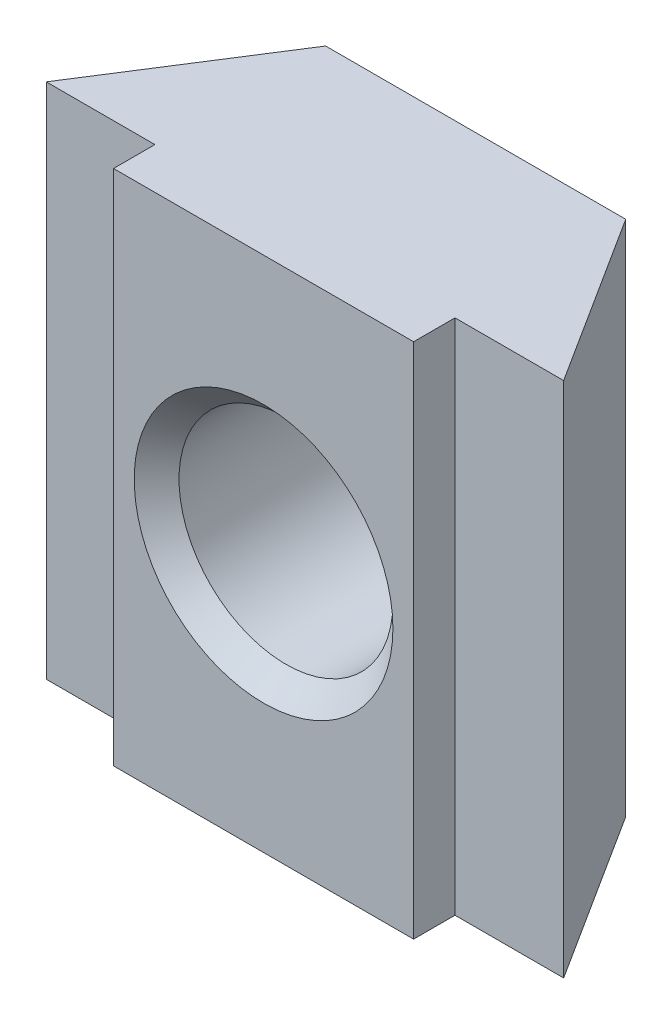
ISO-10303-21;
HEADER;
FILE_DESCRIPTION(('STEP AP214'),'2;1');
FILE_NAME('part.step','',(''),(''),'','','');
FILE_SCHEMA(('AUTOMOTIVE_DESIGN { 1 0 10303 214 1 1 1 1 }'));
ENDSEC;
DATA;
#1=APPLICATION_CONTEXT('core data for automotive mechanical design processes');
#2=APPLICATION_PROTOCOL_DEFINITION('international standard','automotive_design',2000,#1);
#3=PRODUCT_CONTEXT('',#1,'mechanical');
#4=PRODUCT('Part','Part','',(#3));
#5=PRODUCT_RELATED_PRODUCT_CATEGORY('part','',(#4));
#6=PRODUCT_DEFINITION_FORMATION('','',#4);
#7=PRODUCT_DEFINITION_CONTEXT('part definition',#1,'design');
#8=PRODUCT_DEFINITION('design','',#6,#7);
#9=PRODUCT_DEFINITION_SHAPE('','',#8);
#10=(LENGTH_UNIT() NAMED_UNIT(*) SI_UNIT(.MILLI.,.METRE.));
#11=(NAMED_UNIT(*) PLANE_ANGLE_UNIT() SI_UNIT($,.RADIAN.));
#12=(NAMED_UNIT(*) SI_UNIT($,.STERADIAN.) SOLID_ANGLE_UNIT());
#13=UNCERTAINTY_MEASURE_WITH_UNIT(LENGTH_MEASURE(1.E-05),#10,'distance_accuracy_value','');
#14=(GEOMETRIC_REPRESENTATION_CONTEXT(3) GLOBAL_UNCERTAINTY_ASSIGNED_CONTEXT((#13)) GLOBAL_UNIT_ASSIGNED_CONTEXT((#10,
#11,#12)) REPRESENTATION_CONTEXT('',''));
#15=CARTESIAN_POINT('',(0.,0.,0.));
#16=DIRECTION('',(0.,0.,1.));
#17=DIRECTION('',(1.,0.,0.));
#18=AXIS2_PLACEMENT_3D('',#15,#16,#17);
#19=CARTESIAN_POINT('',(13.,-21.5,-9.30000000010978));
#20=DIRECTION('',(0.,0.,1.));
#21=DIRECTION('',(1.,0.,0.));
#22=AXIS2_PLACEMENT_3D('',#19,#20,#21);
#23=CONICAL_SURFACE('',#22,2.49999999990723,0.785398163397448);
#24=CARTESIAN_POINT('',(13.,-21.5,-9.29999999999609));
#25=DIRECTION('',(0.,0.,1.));
#26=DIRECTION('',(1.,0.,0.));
#27=AXIS2_PLACEMENT_3D('',#24,#25,#26);
#28=CIRCLE('',#27,2.50000000002092);
#29=CARTESIAN_POINT('',(15.5000000000209,-21.5,-9.29999999999609));
#30=VERTEX_POINT('',#29);
#31=EDGE_CURVE('E20',#30,#30,#28,.F.);
#32=ORIENTED_EDGE('',*,*,#31,.F.);
#33=EDGE_LOOP('',(#32));
#34=FACE_BOUND('',#33,.T.);
#35=CARTESIAN_POINT('',(13.,-21.5,-9.733));
#36=DIRECTION('',(0.,0.,1.));
#37=DIRECTION('',(1.,0.,0.));
#38=AXIS2_PLACEMENT_3D('',#35,#36,#37);
#39=CIRCLE('',#38,2.067);
#40=CARTESIAN_POINT('',(15.067,-21.5,-9.733));
#41=VERTEX_POINT('',#40);
#42=EDGE_CURVE('E122',#41,#41,#39,.F.);
#43=ORIENTED_EDGE('',*,*,#42,.T.);
#44=EDGE_LOOP('',(#43));
#45=FACE_BOUND('',#44,.T.);
#46=ADVANCED_FACE('F17',(#34,#45),#23,.F.);
#47=CARTESIAN_POINT('',(10.1,-26.5,-9.3));
#48=DIRECTION('',(-1.,0.,0.));
#49=DIRECTION('',(0.,0.,1.));
#50=AXIS2_PLACEMENT_3D('',#47,#48,#49);
#51=PLANE('',#50);
#52=DIRECTION('',(0.,0.,1.));
#53=VECTOR('',#52,1.);
#54=CARTESIAN_POINT('',(10.1,-26.5,-9.3));
#55=LINE('',#54,#53);
#56=CARTESIAN_POINT('',(10.1,-26.5,-10.1));
#57=VERTEX_POINT('',#56);
#58=CARTESIAN_POINT('',(10.1,-26.5,-9.3));
#59=VERTEX_POINT('',#58);
#60=EDGE_CURVE('E125',#57,#59,#55,.T.);
#61=ORIENTED_EDGE('',*,*,#60,.T.);
#62=DIRECTION('',(0.,1.,0.));
#63=VECTOR('',#62,1.);
#64=CARTESIAN_POINT('',(10.1,-26.5,-9.3));
#65=LINE('',#64,#63);
#66=CARTESIAN_POINT('',(10.1,-16.5,-9.3));
#67=VERTEX_POINT('',#66);
#68=EDGE_CURVE('E104',#67,#59,#65,.F.);
#69=ORIENTED_EDGE('',*,*,#68,.F.);
#70=DIRECTION('',(0.,0.,1.));
#71=VECTOR('',#70,1.);
#72=CARTESIAN_POINT('',(10.1,-16.5,-9.3));
#73=LINE('',#72,#71);
#74=CARTESIAN_POINT('',(10.1,-16.5,-10.1));
#75=VERTEX_POINT('',#74);
#76=EDGE_CURVE('E79',#67,#75,#73,.F.);
#77=ORIENTED_EDGE('',*,*,#76,.T.);
#78=DIRECTION('',(0.,1.,0.));
#79=VECTOR('',#78,1.);
#80=CARTESIAN_POINT('',(10.1,-26.5,-10.1));
#81=LINE('',#80,#79);
#82=EDGE_CURVE('E103',#57,#75,#81,.T.);
#83=ORIENTED_EDGE('',*,*,#82,.F.);
#84=EDGE_LOOP('',(#61,#69,#77,#83));
#85=FACE_BOUND('',#84,.T.);
#86=ADVANCED_FACE('F263',(#85),#51,.T.);
#87=CARTESIAN_POINT('',(13.,-21.5,-11.35));
#88=DIRECTION('',(0.,0.,1.));
#89=DIRECTION('',(1.,0.,0.));
#90=AXIS2_PLACEMENT_3D('',#87,#88,#89);
#91=CYLINDRICAL_SURFACE('',#90,2.067);
#92=CARTESIAN_POINT('',(13.,-21.5,-12.9670000000601));
#93=DIRECTION('',(0.,0.,-1.));
#94=DIRECTION('',(-1.,0.,0.));
#95=AXIS2_PLACEMENT_3D('',#92,#93,#94);
#96=CIRCLE('',#95,2.06700000003411);
#97=CARTESIAN_POINT('',(10.9329999999659,-21.5,-12.9670000000601));
#98=VERTEX_POINT('',#97);
#99=EDGE_CURVE('E116',#98,#98,#96,.T.);
#100=ORIENTED_EDGE('',*,*,#99,.T.);
#101=EDGE_LOOP('',(#100));
#102=FACE_BOUND('',#101,.T.);
#103=ORIENTED_EDGE('',*,*,#42,.F.);
#104=EDGE_LOOP('',(#103));
#105=FACE_BOUND('',#104,.T.);
#106=ADVANCED_FACE('F254',(#102,#105),#91,.F.);
#107=CARTESIAN_POINT('',(15.9,-26.5,-10.1));
#108=DIRECTION('',(1.,0.,0.));
#109=DIRECTION('',(0.,0.,-1.));
#110=AXIS2_PLACEMENT_3D('',#107,#108,#109);
#111=PLANE('',#110);
#112=DIRECTION('',(0.,0.,-1.));
#113=VECTOR('',#112,1.);
#114=CARTESIAN_POINT('',(15.9,-26.5,-10.1));
#115=LINE('',#114,#113);
#116=CARTESIAN_POINT('',(15.9,-26.5,-9.3));
#117=VERTEX_POINT('',#116);
#118=CARTESIAN_POINT('',(15.9,-26.5,-10.1));
#119=VERTEX_POINT('',#118);
#120=EDGE_CURVE('E120',#117,#119,#115,.T.);
#121=ORIENTED_EDGE('',*,*,#120,.T.);
#122=DIRECTION('',(0.,1.,0.));
#123=VECTOR('',#122,1.);
#124=CARTESIAN_POINT('',(15.9,-26.5,-10.1));
#125=LINE('',#124,#123);
#126=CARTESIAN_POINT('',(15.9,-16.5,-10.1));
#127=VERTEX_POINT('',#126);
#128=EDGE_CURVE('E91',#127,#119,#125,.F.);
#129=ORIENTED_EDGE('',*,*,#128,.F.);
#130=DIRECTION('',(0.,0.,-1.));
#131=VECTOR('',#130,1.);
#132=CARTESIAN_POINT('',(15.9,-16.5,-9.3));
#133=LINE('',#132,#131);
#134=CARTESIAN_POINT('',(15.9,-16.5,-9.3));
#135=VERTEX_POINT('',#134);
#136=EDGE_CURVE('E85',#127,#135,#133,.F.);
#137=ORIENTED_EDGE('',*,*,#136,.T.);
#138=DIRECTION('',(0.,1.,0.));
#139=VECTOR('',#138,1.);
#140=CARTESIAN_POINT('',(15.9,-26.5,-9.3));
#141=LINE('',#140,#139);
#142=EDGE_CURVE('E88',#117,#135,#141,.T.);
#143=ORIENTED_EDGE('',*,*,#142,.F.);
#144=EDGE_LOOP('',(#121,#129,#137,#143));
#145=FACE_BOUND('',#144,.T.);
#146=ADVANCED_FACE('F87',(#145),#111,.T.);
#147=CARTESIAN_POINT('',(15.9,-26.5,-9.3));
#148=DIRECTION('',(0.,0.,1.));
#149=DIRECTION('',(1.,0.,0.));
#150=AXIS2_PLACEMENT_3D('',#147,#148,#149);
#151=PLANE('',#150);
#152=DIRECTION('',(1.,0.,0.));
#153=VECTOR('',#152,1.);
#154=CARTESIAN_POINT('',(13.,-26.5,-9.3));
#155=LINE('',#154,#153);
#156=EDGE_CURVE('E102',#117,#59,#155,.F.);
#157=ORIENTED_EDGE('',*,*,#156,.F.);
#158=ORIENTED_EDGE('',*,*,#142,.T.);
#159=DIRECTION('',(1.,0.,0.));
#160=VECTOR('',#159,1.);
#161=CARTESIAN_POINT('',(13.,-16.5,-9.3));
#162=LINE('',#161,#160);
#163=EDGE_CURVE('E93',#135,#67,#162,.F.);
#164=ORIENTED_EDGE('',*,*,#163,.T.);
#165=ORIENTED_EDGE('',*,*,#68,.T.);
#166=EDGE_LOOP('',(#157,#158,#164,#165));
#167=FACE_BOUND('',#166,.T.);
#168=ORIENTED_EDGE('',*,*,#31,.T.);
#169=EDGE_LOOP('',(#168));
#170=FACE_BOUND('',#169,.T.);
#171=ADVANCED_FACE('F98',(#167,#170),#151,.T.);
#172=CARTESIAN_POINT('',(10.1,-26.5,-10.1));
#173=DIRECTION('',(0.,0.,1.));
#174=DIRECTION('',(1.,0.,0.));
#175=AXIS2_PLACEMENT_3D('',#172,#173,#174);
#176=PLANE('',#175);
#177=DIRECTION('',(1.,0.,0.));
#178=VECTOR('',#177,1.);
#179=CARTESIAN_POINT('',(13.,-26.5,-10.1));
#180=LINE('',#179,#178);
#181=CARTESIAN_POINT('',(8.,-26.5,-10.1));
#182=VERTEX_POINT('',#181);
#183=EDGE_CURVE('E137',#57,#182,#180,.F.);
#184=ORIENTED_EDGE('',*,*,#183,.F.);
#185=ORIENTED_EDGE('',*,*,#82,.T.);
#186=DIRECTION('',(1.,0.,0.));
#187=VECTOR('',#186,1.);
#188=CARTESIAN_POINT('',(13.,-16.5,-10.1));
#189=LINE('',#188,#187);
#190=CARTESIAN_POINT('',(8.,-16.5,-10.1));
#191=VERTEX_POINT('',#190);
#192=EDGE_CURVE('E108',#75,#191,#189,.F.);
#193=ORIENTED_EDGE('',*,*,#192,.T.);
#194=DIRECTION('',(0.,1.,0.));
#195=VECTOR('',#194,1.);
#196=CARTESIAN_POINT('',(8.,-26.5,-10.1));
#197=LINE('',#196,#195);
#198=EDGE_CURVE('E94',#182,#191,#197,.T.);
#199=ORIENTED_EDGE('',*,*,#198,.F.);
#200=EDGE_LOOP('',(#184,#185,#193,#199));
#201=FACE_BOUND('',#200,.T.);
#202=ADVANCED_FACE('F227',(#201),#176,.T.);
#203=CARTESIAN_POINT('',(13.,-21.5,-13.3999999999332));
#204=DIRECTION('',(0.,0.,-1.));
#205=DIRECTION('',(-1.,0.,0.));
#206=AXIS2_PLACEMENT_3D('',#203,#204,#205);
#207=CONICAL_SURFACE('',#206,2.49999999990723,0.785398163397448);
#208=CARTESIAN_POINT('',(13.,-21.5,-13.3999999999901));
#209=DIRECTION('',(0.,0.,-1.));
#210=DIRECTION('',(-1.,0.,0.));
#211=AXIS2_PLACEMENT_3D('',#208,#209,#210);
#212=CIRCLE('',#211,2.49999999996408);
#213=CARTESIAN_POINT('',(10.5000000000359,-21.5,-13.3999999999901));
#214=VERTEX_POINT('',#213);
#215=EDGE_CURVE('E129',#214,#214,#212,.F.);
#216=ORIENTED_EDGE('',*,*,#215,.F.);
#217=EDGE_LOOP('',(#216));
#218=FACE_BOUND('',#217,.T.);
#219=ORIENTED_EDGE('',*,*,#99,.F.);
#220=EDGE_LOOP('',(#219));
#221=FACE_BOUND('',#220,.T.);
#222=ADVANCED_FACE('F218',(#218,#221),#207,.F.);
#223=CARTESIAN_POINT('',(8.,-26.5,-10.1));
#224=DIRECTION('',(-0.843661487732107,0.,-0.536875492193159));
#225=DIRECTION('',(-0.536875492193159,0.,0.843661487732107));
#226=AXIS2_PLACEMENT_3D('',#223,#224,#225);
#227=PLANE('',#226);
#228=DIRECTION('',(0.536875492193159,0.,-0.843661487732108));
#229=VECTOR('',#228,1.);
#230=CARTESIAN_POINT('',(8.,-26.5,-10.1));
#231=LINE('',#230,#229);
#232=CARTESIAN_POINT('',(10.1,-26.5,-13.4));
#233=VERTEX_POINT('',#232);
#234=EDGE_CURVE('E132',#182,#233,#231,.T.);
#235=ORIENTED_EDGE('',*,*,#234,.F.);
#236=ORIENTED_EDGE('',*,*,#198,.T.);
#237=DIRECTION('',(0.536875492193159,0.,-0.843661487732108));
#238=VECTOR('',#237,1.);
#239=CARTESIAN_POINT('',(8.,-16.5,-10.1));
#240=LINE('',#239,#238);
#241=CARTESIAN_POINT('',(10.1,-16.5,-13.4));
#242=VERTEX_POINT('',#241);
#243=EDGE_CURVE('E110',#191,#242,#240,.T.);
#244=ORIENTED_EDGE('',*,*,#243,.T.);
#245=DIRECTION('',(0.,1.,0.));
#246=VECTOR('',#245,1.);
#247=CARTESIAN_POINT('',(10.1,-26.5,-13.4));
#248=LINE('',#247,#246);
#249=EDGE_CURVE('E155',#233,#242,#248,.T.);
#250=ORIENTED_EDGE('',*,*,#249,.F.);
#251=EDGE_LOOP('',(#235,#236,#244,#250));
#252=FACE_BOUND('',#251,.T.);
#253=ADVANCED_FACE('F153',(#252),#227,.T.);
#254=CARTESIAN_POINT('',(13.,-16.5,-9.3));
#255=DIRECTION('',(0.,-1.,0.));
#256=DIRECTION('',(0.,0.,-1.));
#257=AXIS2_PLACEMENT_3D('',#254,#255,#256);
#258=PLANE('',#257);
#259=DIRECTION('',(-1.,0.,0.));
#260=VECTOR('',#259,1.);
#261=CARTESIAN_POINT('',(10.1,-16.5,-13.4));
#262=LINE('',#261,#260);
#263=CARTESIAN_POINT('',(15.9,-16.5,-13.4));
#264=VERTEX_POINT('',#263);
#265=EDGE_CURVE('E131',#242,#264,#262,.F.);
#266=ORIENTED_EDGE('',*,*,#265,.F.);
#267=ORIENTED_EDGE('',*,*,#243,.F.);
#268=ORIENTED_EDGE('',*,*,#192,.F.);
#269=ORIENTED_EDGE('',*,*,#76,.F.);
#270=ORIENTED_EDGE('',*,*,#163,.F.);
#271=ORIENTED_EDGE('',*,*,#136,.F.);
#272=DIRECTION('',(1.,0.,0.));
#273=VECTOR('',#272,1.);
#274=CARTESIAN_POINT('',(18.,-16.5,-10.1));
#275=LINE('',#274,#273);
#276=CARTESIAN_POINT('',(18.,-16.5,-10.1));
#277=VERTEX_POINT('',#276);
#278=EDGE_CURVE('E150',#277,#127,#275,.F.);
#279=ORIENTED_EDGE('',*,*,#278,.F.);
#280=DIRECTION('',(-0.536875492193159,0.,-0.843661487732107));
#281=VECTOR('',#280,1.);
#282=CARTESIAN_POINT('',(15.9,-16.5,-13.4));
#283=LINE('',#282,#281);
#284=EDGE_CURVE('E157',#264,#277,#283,.F.);
#285=ORIENTED_EDGE('',*,*,#284,.F.);
#286=EDGE_LOOP('',(#266,#267,#268,#269,#270,#271,#279,#285));
#287=FACE_BOUND('',#286,.T.);
#288=ADVANCED_FACE('F107',(#287),#258,.F.);
#289=CARTESIAN_POINT('',(18.,-26.5,-10.1));
#290=DIRECTION('',(0.,0.,1.));
#291=DIRECTION('',(1.,0.,0.));
#292=AXIS2_PLACEMENT_3D('',#289,#290,#291);
#293=PLANE('',#292);
#294=DIRECTION('',(1.,0.,0.));
#295=VECTOR('',#294,1.);
#296=CARTESIAN_POINT('',(13.,-26.5,-10.1));
#297=LINE('',#296,#295);
#298=CARTESIAN_POINT('',(18.,-26.5,-10.1));
#299=VERTEX_POINT('',#298);
#300=EDGE_CURVE('E146',#299,#119,#297,.F.);
#301=ORIENTED_EDGE('',*,*,#300,.F.);
#302=DIRECTION('',(0.,1.,0.));
#303=VECTOR('',#302,1.);
#304=CARTESIAN_POINT('',(18.,-26.5,-10.1));
#305=LINE('',#304,#303);
#306=EDGE_CURVE('E161',#277,#299,#305,.F.);
#307=ORIENTED_EDGE('',*,*,#306,.F.);
#308=ORIENTED_EDGE('',*,*,#278,.T.);
#309=ORIENTED_EDGE('',*,*,#128,.T.);
#310=EDGE_LOOP('',(#301,#307,#308,#309));
#311=FACE_BOUND('',#310,.T.);
#312=ADVANCED_FACE('F172',(#311),#293,.T.);
#313=CARTESIAN_POINT('',(13.,-26.5,-9.3));
#314=DIRECTION('',(0.,-1.,0.));
#315=DIRECTION('',(0.,0.,-1.));
#316=AXIS2_PLACEMENT_3D('',#313,#314,#315);
#317=PLANE('',#316);
#318=ORIENTED_EDGE('',*,*,#183,.T.);
#319=ORIENTED_EDGE('',*,*,#234,.T.);
#320=DIRECTION('',(-1.,0.,0.));
#321=VECTOR('',#320,1.);
#322=CARTESIAN_POINT('',(10.1,-26.5,-13.4));
#323=LINE('',#322,#321);
#324=CARTESIAN_POINT('',(15.9,-26.5,-13.4));
#325=VERTEX_POINT('',#324);
#326=EDGE_CURVE('E35',#325,#233,#323,.T.);
#327=ORIENTED_EDGE('',*,*,#326,.F.);
#328=DIRECTION('',(-0.536875492193159,0.,-0.843661487732107));
#329=VECTOR('',#328,1.);
#330=CARTESIAN_POINT('',(15.9,-26.5,-13.4));
#331=LINE('',#330,#329);
#332=EDGE_CURVE('E26',#299,#325,#331,.T.);
#333=ORIENTED_EDGE('',*,*,#332,.F.);
#334=ORIENTED_EDGE('',*,*,#300,.T.);
#335=ORIENTED_EDGE('',*,*,#120,.F.);
#336=ORIENTED_EDGE('',*,*,#156,.T.);
#337=ORIENTED_EDGE('',*,*,#60,.F.);
#338=EDGE_LOOP('',(#318,#319,#327,#333,#334,#335,#336,#337));
#339=FACE_BOUND('',#338,.T.);
#340=ADVANCED_FACE('F170',(#339),#317,.T.);
#341=CARTESIAN_POINT('',(10.1,-26.5,-13.4));
#342=DIRECTION('',(0.,0.,-1.));
#343=DIRECTION('',(-1.,0.,0.));
#344=AXIS2_PLACEMENT_3D('',#341,#342,#343);
#345=PLANE('',#344);
#346=ORIENTED_EDGE('',*,*,#326,.T.);
#347=ORIENTED_EDGE('',*,*,#249,.T.);
#348=ORIENTED_EDGE('',*,*,#265,.T.);
#349=DIRECTION('',(0.,1.,0.));
#350=VECTOR('',#349,1.);
#351=CARTESIAN_POINT('',(15.9,-26.5,-13.4));
#352=LINE('',#351,#350);
#353=EDGE_CURVE('E11',#325,#264,#352,.T.);
#354=ORIENTED_EDGE('',*,*,#353,.F.);
#355=EDGE_LOOP('',(#346,#347,#348,#354));
#356=FACE_BOUND('',#355,.T.);
#357=ORIENTED_EDGE('',*,*,#215,.T.);
#358=EDGE_LOOP('',(#357));
#359=FACE_BOUND('',#358,.T.);
#360=ADVANCED_FACE('F159',(#356,#359),#345,.T.);
#361=CARTESIAN_POINT('',(15.9,-26.5,-13.4));
#362=DIRECTION('',(0.843661487732107,0.,-0.536875492193159));
#363=DIRECTION('',(-0.536875492193159,0.,-0.843661487732107));
#364=AXIS2_PLACEMENT_3D('',#361,#362,#363);
#365=PLANE('',#364);
#366=ORIENTED_EDGE('',*,*,#332,.T.);
#367=ORIENTED_EDGE('',*,*,#353,.T.);
#368=ORIENTED_EDGE('',*,*,#284,.T.);
#369=ORIENTED_EDGE('',*,*,#306,.T.);
#370=EDGE_LOOP('',(#366,#367,#368,#369));
#371=FACE_BOUND('',#370,.T.);
#372=ADVANCED_FACE('F168',(#371),#365,.T.);
#373=CLOSED_SHELL('',(#46,#86,#106,#146,#171,#202,#222,#253,#288,#312,#340,#360,#372));
#374=MANIFOLD_SOLID_BREP('B1',#373);
#375=ADVANCED_BREP_SHAPE_REPRESENTATION('',(#18,#374),#14);
#376=SHAPE_DEFINITION_REPRESENTATION(#9,#375);
ENDSEC;
END-ISO-10303-21;
